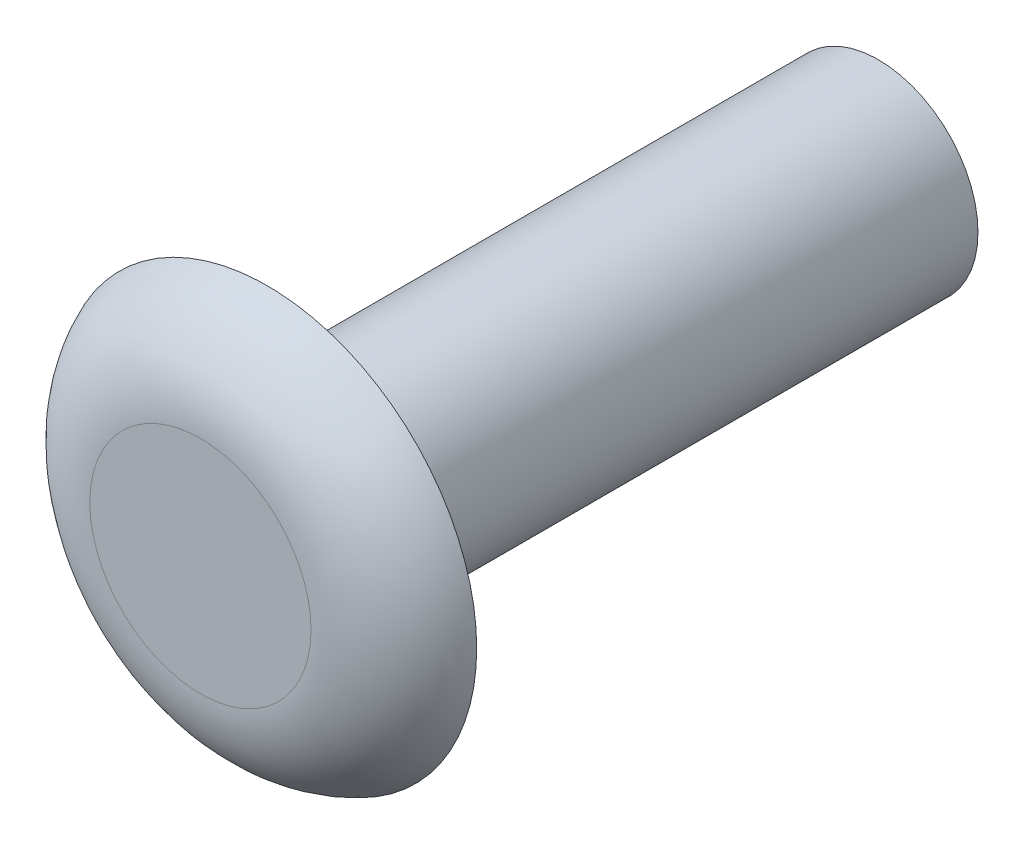
ISO-10303-21;
HEADER;
FILE_DESCRIPTION(('STEP AP214'),'2;1');
FILE_NAME('part.step','',(''),(''),'','','');
FILE_SCHEMA(('AUTOMOTIVE_DESIGN { 1 0 10303 214 1 1 1 1 }'));
ENDSEC;
DATA;
#1=APPLICATION_CONTEXT('core data for automotive mechanical design processes');
#2=APPLICATION_PROTOCOL_DEFINITION('international standard','automotive_design',2000,#1);
#3=PRODUCT_CONTEXT('',#1,'mechanical');
#4=PRODUCT('Part','Part','',(#3));
#5=PRODUCT_RELATED_PRODUCT_CATEGORY('part','',(#4));
#6=PRODUCT_DEFINITION_FORMATION('','',#4);
#7=PRODUCT_DEFINITION_CONTEXT('part definition',#1,'design');
#8=PRODUCT_DEFINITION('design','',#6,#7);
#9=PRODUCT_DEFINITION_SHAPE('','',#8);
#10=(LENGTH_UNIT() NAMED_UNIT(*) SI_UNIT(.MILLI.,.METRE.));
#11=(NAMED_UNIT(*) PLANE_ANGLE_UNIT() SI_UNIT($,.RADIAN.));
#12=(NAMED_UNIT(*) SI_UNIT($,.STERADIAN.) SOLID_ANGLE_UNIT());
#13=UNCERTAINTY_MEASURE_WITH_UNIT(LENGTH_MEASURE(1.E-05),#10,'distance_accuracy_value','');
#14=(GEOMETRIC_REPRESENTATION_CONTEXT(3) GLOBAL_UNCERTAINTY_ASSIGNED_CONTEXT((#13)) GLOBAL_UNIT_ASSIGNED_CONTEXT((#10,
#11,#12)) REPRESENTATION_CONTEXT('',''));
#15=CARTESIAN_POINT('',(0.,0.,0.));
#16=DIRECTION('',(0.,0.,1.));
#17=DIRECTION('',(1.,0.,0.));
#18=AXIS2_PLACEMENT_3D('',#15,#16,#17);
#19=CARTESIAN_POINT('',(0.,0.,1.6002));
#20=DIRECTION('',(0.,0.,1.));
#21=DIRECTION('',(1.,0.,0.));
#22=AXIS2_PLACEMENT_3D('',#19,#20,#21);
#23=PLANE('',#22);
#24=CARTESIAN_POINT('',(0.,0.,1.6002));
#25=DIRECTION('',(0.,0.,1.));
#26=DIRECTION('',(1.,0.,0.));
#27=AXIS2_PLACEMENT_3D('',#24,#25,#26);
#28=CIRCLE('',#27,2.64405934475841);
#29=CARTESIAN_POINT('',(2.64405934475841,0.,1.6002));
#30=VERTEX_POINT('',#29);
#31=EDGE_CURVE('E10',#30,#30,#28,.T.);
#32=ORIENTED_EDGE('',*,*,#31,.T.);
#33=EDGE_LOOP('',(#32));
#34=FACE_BOUND('',#33,.T.);
#35=ADVANCED_FACE('F34',(#34),#23,.T.);
#36=CARTESIAN_POINT('',(0.,0.,0.));
#37=DIRECTION('',(0.,0.,1.));
#38=DIRECTION('',(1.,0.,0.));
#39=AXIS2_PLACEMENT_3D('',#36,#37,#38);
#40=PLANE('',#39);
#41=CARTESIAN_POINT('',(0.,0.,0.));
#42=DIRECTION('',(0.,0.,1.));
#43=DIRECTION('',(1.,0.,0.));
#44=AXIS2_PLACEMENT_3D('',#41,#42,#43);
#45=CIRCLE('',#44,2.38125);
#46=CARTESIAN_POINT('',(2.38125,0.,0.));
#47=VERTEX_POINT('',#46);
#48=EDGE_CURVE('E49',#47,#47,#45,.T.);
#49=ORIENTED_EDGE('',*,*,#48,.T.);
#50=EDGE_LOOP('',(#49));
#51=FACE_BOUND('',#50,.T.);
#52=CARTESIAN_POINT('',(0.,0.,0.));
#53=DIRECTION('',(0.,0.,1.));
#54=DIRECTION('',(1.,0.,0.));
#55=AXIS2_PLACEMENT_3D('',#52,#53,#54);
#56=CIRCLE('',#55,5.0038);
#57=CARTESIAN_POINT('',(5.0038,0.,0.));
#58=VERTEX_POINT('',#57);
#59=EDGE_CURVE('E41',#58,#58,#56,.T.);
#60=ORIENTED_EDGE('',*,*,#59,.F.);
#61=EDGE_LOOP('',(#60));
#62=FACE_BOUND('',#61,.T.);
#63=ADVANCED_FACE('F55',(#51,#62),#40,.F.);
#64=CARTESIAN_POINT('',(0.,0.,-14.605));
#65=DIRECTION('',(0.,0.,1.));
#66=DIRECTION('',(1.,0.,0.));
#67=AXIS2_PLACEMENT_3D('',#64,#65,#66);
#68=CYLINDRICAL_SURFACE('',#67,2.38125);
#69=CARTESIAN_POINT('',(0.,0.,-14.605));
#70=DIRECTION('',(0.,0.,1.));
#71=DIRECTION('',(1.,0.,0.));
#72=AXIS2_PLACEMENT_3D('',#69,#70,#71);
#73=CIRCLE('',#72,2.38125);
#74=CARTESIAN_POINT('',(2.38125,0.,-14.605));
#75=VERTEX_POINT('',#74);
#76=EDGE_CURVE('E45',#75,#75,#73,.T.);
#77=CARTESIAN_POINT('',(2.38125,0.,-14.605));
#78=CARTESIAN_POINT('',(2.38125,0.,-14.4528645833333));
#79=CARTESIAN_POINT('',(2.38125,0.,-14.3007291666667));
#80=CARTESIAN_POINT('',(2.38125,0.,-13.9964583333333));
#81=CARTESIAN_POINT('',(2.38125,0.,-13.8443229166667));
#82=CARTESIAN_POINT('',(2.38125,0.,-13.5400520833333));
#83=CARTESIAN_POINT('',(2.38125,0.,-13.3879166666667));
#84=CARTESIAN_POINT('',(2.38125,0.,-13.0836458333333));
#85=CARTESIAN_POINT('',(2.38125,0.,-12.9315104166667));
#86=CARTESIAN_POINT('',(2.38125,0.,-12.6272395833333));
#87=CARTESIAN_POINT('',(2.38125,0.,-12.4751041666667));
#88=CARTESIAN_POINT('',(2.38125,0.,-12.1708333333333));
#89=CARTESIAN_POINT('',(2.38125,0.,-12.0186979166667));
#90=CARTESIAN_POINT('',(2.38125,0.,-11.7144270833333));
#91=CARTESIAN_POINT('',(2.38125,0.,-11.5622916666667));
#92=CARTESIAN_POINT('',(2.38125,0.,-11.2580208333333));
#93=CARTESIAN_POINT('',(2.38125,0.,-11.1058854166667));
#94=CARTESIAN_POINT('',(2.38125,0.,-10.8016145833333));
#95=CARTESIAN_POINT('',(2.38125,0.,-10.6494791666667));
#96=CARTESIAN_POINT('',(2.38125,0.,-10.3452083333333));
#97=CARTESIAN_POINT('',(2.38125,0.,-10.1930729166667));
#98=CARTESIAN_POINT('',(2.38125,0.,-9.88880208333333));
#99=CARTESIAN_POINT('',(2.38125,0.,-9.73666666666667));
#100=CARTESIAN_POINT('',(2.38125,0.,-9.43239583333333));
#101=CARTESIAN_POINT('',(2.38125,0.,-9.28026041666667));
#102=CARTESIAN_POINT('',(2.38125,0.,-8.97598958333333));
#103=CARTESIAN_POINT('',(2.38125,0.,-8.82385416666667));
#104=CARTESIAN_POINT('',(2.38125,0.,-8.51958333333333));
#105=CARTESIAN_POINT('',(2.38125,0.,-8.36744791666667));
#106=CARTESIAN_POINT('',(2.38125,0.,-8.06317708333333));
#107=CARTESIAN_POINT('',(2.38125,0.,-7.91104166666667));
#108=CARTESIAN_POINT('',(2.38125,0.,-7.60677083333333));
#109=CARTESIAN_POINT('',(2.38125,0.,-7.45463541666667));
#110=CARTESIAN_POINT('',(2.38125,0.,-7.15036458333333));
#111=CARTESIAN_POINT('',(2.38125,0.,-6.99822916666667));
#112=CARTESIAN_POINT('',(2.38125,0.,-6.69395833333333));
#113=CARTESIAN_POINT('',(2.38125,0.,-6.54182291666667));
#114=CARTESIAN_POINT('',(2.38125,0.,-6.23755208333333));
#115=CARTESIAN_POINT('',(2.38125,0.,-6.08541666666667));
#116=CARTESIAN_POINT('',(2.38125,0.,-5.78114583333333));
#117=CARTESIAN_POINT('',(2.38125,0.,-5.62901041666667));
#118=CARTESIAN_POINT('',(2.38125,0.,-5.32473958333333));
#119=CARTESIAN_POINT('',(2.38125,0.,-5.17260416666667));
#120=CARTESIAN_POINT('',(2.38125,0.,-4.86833333333333));
#121=CARTESIAN_POINT('',(2.38125,0.,-4.71619791666667));
#122=CARTESIAN_POINT('',(2.38125,0.,-4.41192708333333));
#123=CARTESIAN_POINT('',(2.38125,0.,-4.25979166666667));
#124=CARTESIAN_POINT('',(2.38125,0.,-3.95552083333333));
#125=CARTESIAN_POINT('',(2.38125,0.,-3.80338541666667));
#126=CARTESIAN_POINT('',(2.38125,0.,-3.49911458333333));
#127=CARTESIAN_POINT('',(2.38125,0.,-3.34697916666667));
#128=CARTESIAN_POINT('',(2.38125,0.,-3.04270833333333));
#129=CARTESIAN_POINT('',(2.38125,0.,-2.89057291666667));
#130=CARTESIAN_POINT('',(2.38125,0.,-2.58630208333333));
#131=CARTESIAN_POINT('',(2.38125,0.,-2.43416666666667));
#132=CARTESIAN_POINT('',(2.38125,0.,-2.12989583333333));
#133=CARTESIAN_POINT('',(2.38125,0.,-1.97776041666667));
#134=CARTESIAN_POINT('',(2.38125,0.,-1.67348958333333));
#135=CARTESIAN_POINT('',(2.38125,0.,-1.52135416666667));
#136=CARTESIAN_POINT('',(2.38125,0.,-1.21708333333333));
#137=CARTESIAN_POINT('',(2.38125,0.,-1.06494791666667));
#138=CARTESIAN_POINT('',(2.38125,0.,-0.760677083333333));
#139=CARTESIAN_POINT('',(2.38125,0.,-0.608541666666666));
#140=CARTESIAN_POINT('',(2.38125,0.,-0.304270833333333));
#141=CARTESIAN_POINT('',(2.38125,0.,-0.152135416666666));
#142=CARTESIAN_POINT('',(2.38125,0.,0.));
#143=B_SPLINE_CURVE_WITH_KNOTS('',3,(#77,#78,#79,#80,#81,#82,#83,#84,#85,#86,#87,#88,#89,#90,
#91,#92,#93,#94,#95,#96,#97,#98,#99,#100,#101,#102,#103,#104,#105,#106,#107,#108,#109,#110,#111,
#112,#113,#114,#115,#116,#117,#118,#119,#120,#121,#122,#123,#124,#125,#126,#127,#128,#129,#130,
#131,#132,#133,#134,#135,#136,#137,#138,#139,#140,#141,#142),.UNSPECIFIED.,.F.,.F.,(4,2,2,2,2,2,
2,2,2,2,2,2,2,2,2,2,2,2,2,2,2,2,2,2,2,2,2,2,2,2,2,2,4),(0.,0.456406249999999,0.912812499999999,
1.36921875,1.825625,2.28203125,2.7384375,3.19484375,3.65125,4.10765625,4.5640625,5.02046875,
5.476875,5.93328125,6.3896875,6.84609375,7.3025,7.75890625,8.2153125,8.67171875,9.128125,
9.58453125,10.0409375,10.49734375,10.95375,11.41015625,11.8665625,12.32296875,12.779375,
13.23578125,13.6921875,14.14859375,14.605),.UNSPECIFIED.);
#144=EDGE_CURVE('BSEAM58',#75,#47,#143,.T.);
#145=ORIENTED_EDGE('',*,*,#76,.T.);
#146=ORIENTED_EDGE('',*,*,#48,.F.);
#147=ORIENTED_EDGE('',*,*,#144,.T.);
#148=ORIENTED_EDGE('',*,*,#144,.F.);
#149=EDGE_LOOP('',(#145,#147,#146,#148));
#150=FACE_BOUND('',#149,.T.);
#151=ADVANCED_FACE('F58',(#150),#68,.T.);
#152=CARTESIAN_POINT('',(0.,0.,-14.605));
#153=DIRECTION('',(0.,0.,1.));
#154=DIRECTION('',(1.,0.,0.));
#155=AXIS2_PLACEMENT_3D('',#152,#153,#154);
#156=PLANE('',#155);
#157=ORIENTED_EDGE('',*,*,#76,.F.);
#158=EDGE_LOOP('',(#157));
#159=FACE_BOUND('',#158,.T.);
#160=ADVANCED_FACE('F60',(#159),#156,.F.);
#161=CARTESIAN_POINT('',(0.,0.,-0.9398));
#162=DIRECTION('',(0.,0.,-1.));
#163=DIRECTION('',(-1.,0.,0.));
#164=AXIS2_PLACEMENT_3D('',#161,#162,#163);
#165=TOROIDAL_SURFACE('',#164,2.64405934475841,2.54);
#166=ORIENTED_EDGE('',*,*,#59,.T.);
#167=EDGE_LOOP('',(#166));
#168=FACE_BOUND('',#167,.T.);
#169=ORIENTED_EDGE('',*,*,#31,.F.);
#170=EDGE_LOOP('',(#169));
#171=FACE_BOUND('',#170,.T.);
#172=ADVANCED_FACE('F36',(#168,#171),#165,.T.);
#173=CLOSED_SHELL('',(#35,#63,#151,#160,#172));
#174=MANIFOLD_SOLID_BREP('B2',#173);
#175=ADVANCED_BREP_SHAPE_REPRESENTATION('',(#18,#174),#14);
#176=SHAPE_DEFINITION_REPRESENTATION(#9,#175);
ENDSEC;
END-ISO-10303-21;
